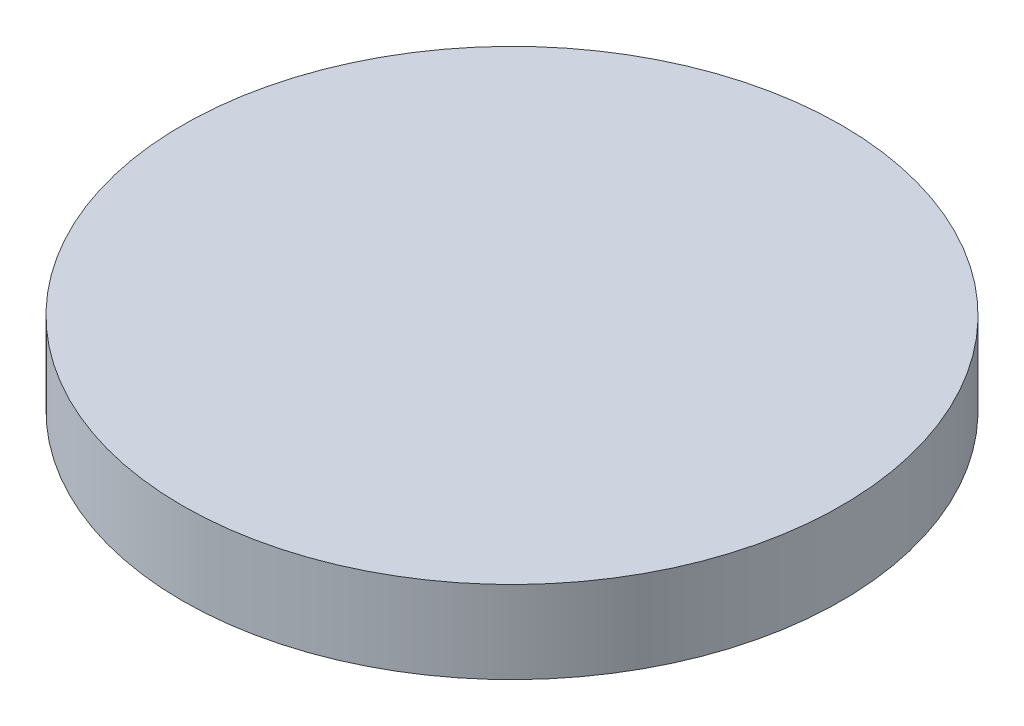
ISO-10303-21;
HEADER;
FILE_DESCRIPTION(('STEP AP214'),'2;1');
FILE_NAME('part.step','',(''),(''),'','','');
FILE_SCHEMA(('AUTOMOTIVE_DESIGN { 1 0 10303 214 1 1 1 1 }'));
ENDSEC;
DATA;
#1=APPLICATION_CONTEXT('core data for automotive mechanical design processes');
#2=APPLICATION_PROTOCOL_DEFINITION('international standard','automotive_design',2000,#1);
#3=PRODUCT_CONTEXT('',#1,'mechanical');
#4=PRODUCT('Part','Part','',(#3));
#5=PRODUCT_RELATED_PRODUCT_CATEGORY('part','',(#4));
#6=PRODUCT_DEFINITION_FORMATION('','',#4);
#7=PRODUCT_DEFINITION_CONTEXT('part definition',#1,'design');
#8=PRODUCT_DEFINITION('design','',#6,#7);
#9=PRODUCT_DEFINITION_SHAPE('','',#8);
#10=(LENGTH_UNIT() NAMED_UNIT(*) SI_UNIT(.MILLI.,.METRE.));
#11=(NAMED_UNIT(*) PLANE_ANGLE_UNIT() SI_UNIT($,.RADIAN.));
#12=(NAMED_UNIT(*) SI_UNIT($,.STERADIAN.) SOLID_ANGLE_UNIT());
#13=UNCERTAINTY_MEASURE_WITH_UNIT(LENGTH_MEASURE(1.E-05),#10,'distance_accuracy_value','');
#14=(GEOMETRIC_REPRESENTATION_CONTEXT(3) GLOBAL_UNCERTAINTY_ASSIGNED_CONTEXT((#13)) GLOBAL_UNIT_ASSIGNED_CONTEXT((#10,
#11,#12)) REPRESENTATION_CONTEXT('',''));
#15=CARTESIAN_POINT('',(0.,0.,0.));
#16=DIRECTION('',(0.,0.,1.));
#17=DIRECTION('',(1.,0.,0.));
#18=AXIS2_PLACEMENT_3D('',#15,#16,#17);
#19=CARTESIAN_POINT('',(0.,10.,0.));
#20=DIRECTION('',(0.,-1.,0.));
#21=DIRECTION('',(0.,0.,-1.));
#22=AXIS2_PLACEMENT_3D('',#19,#20,#21);
#23=CYLINDRICAL_SURFACE('',#22,40.);
#24=CARTESIAN_POINT('',(0.,10.,0.));
#25=DIRECTION('',(0.,1.,0.));
#26=DIRECTION('',(0.,0.,1.));
#27=AXIS2_PLACEMENT_3D('',#24,#25,#26);
#28=CIRCLE('',#27,40.);
#29=CARTESIAN_POINT('',(0.,10.,40.));
#30=VERTEX_POINT('',#29);
#31=EDGE_CURVE('E10',#30,#30,#28,.T.);
#32=ORIENTED_EDGE('',*,*,#31,.F.);
#33=EDGE_LOOP('',(#32));
#34=FACE_BOUND('',#33,.T.);
#35=CARTESIAN_POINT('',(0.,0.,0.));
#36=DIRECTION('',(0.,1.,0.));
#37=DIRECTION('',(0.,0.,1.));
#38=AXIS2_PLACEMENT_3D('',#35,#36,#37);
#39=CIRCLE('',#38,40.);
#40=CARTESIAN_POINT('',(0.,0.,40.));
#41=VERTEX_POINT('',#40);
#42=EDGE_CURVE('E42',#41,#41,#39,.T.);
#43=ORIENTED_EDGE('',*,*,#42,.T.);
#44=EDGE_LOOP('',(#43));
#45=FACE_BOUND('',#44,.T.);
#46=ADVANCED_FACE('F39',(#34,#45),#23,.T.);
#47=CARTESIAN_POINT('',(0.,10.,0.));
#48=DIRECTION('',(0.,1.,0.));
#49=DIRECTION('',(0.,0.,1.));
#50=AXIS2_PLACEMENT_3D('',#47,#48,#49);
#51=PLANE('',#50);
#52=ORIENTED_EDGE('',*,*,#31,.T.);
#53=EDGE_LOOP('',(#52));
#54=FACE_BOUND('',#53,.T.);
#55=ADVANCED_FACE('F54',(#54),#51,.T.);
#56=CARTESIAN_POINT('',(0.,0.,0.));
#57=DIRECTION('',(0.,1.,0.));
#58=DIRECTION('',(0.,0.,1.));
#59=AXIS2_PLACEMENT_3D('',#56,#57,#58);
#60=PLANE('',#59);
#61=ORIENTED_EDGE('',*,*,#42,.F.);
#62=EDGE_LOOP('',(#61));
#63=FACE_BOUND('',#62,.T.);
#64=ADVANCED_FACE('F52',(#63),#60,.F.);
#65=CLOSED_SHELL('',(#46,#55,#64));
#66=MANIFOLD_SOLID_BREP('B2',#65);
#67=ADVANCED_BREP_SHAPE_REPRESENTATION('',(#18,#66),#14);
#68=SHAPE_DEFINITION_REPRESENTATION(#9,#67);
ENDSEC;
END-ISO-10303-21;
